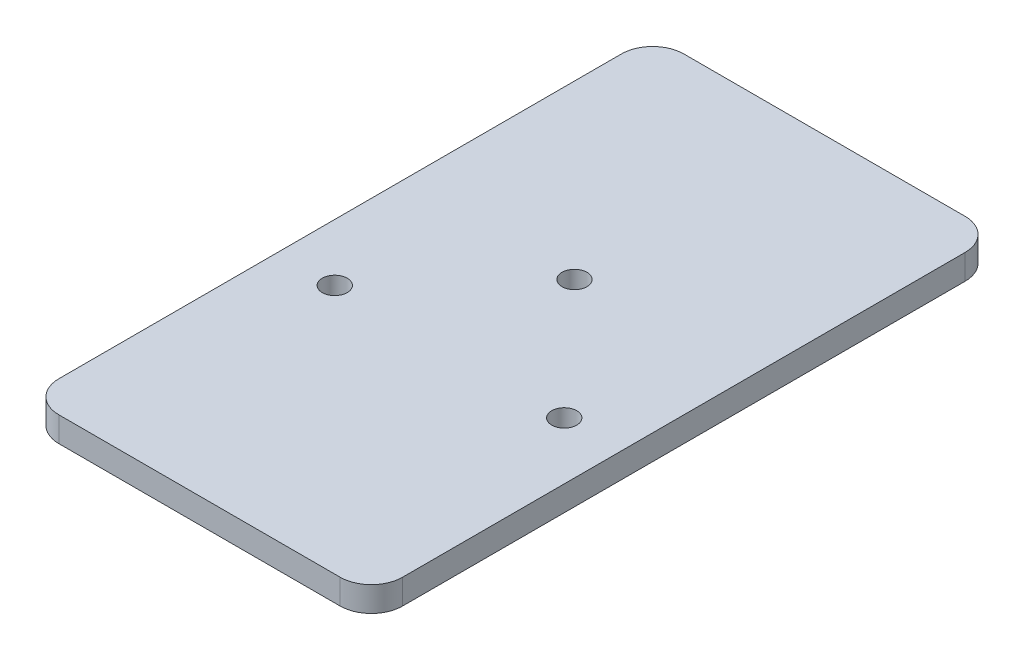
ISO-10303-21;
HEADER;
FILE_DESCRIPTION(('STEP AP214'),'2;1');
FILE_NAME('part.step','',(''),(''),'','','');
FILE_SCHEMA(('AUTOMOTIVE_DESIGN { 1 0 10303 214 1 1 1 1 }'));
ENDSEC;
DATA;
#1=APPLICATION_CONTEXT('core data for automotive mechanical design processes');
#2=APPLICATION_PROTOCOL_DEFINITION('international standard','automotive_design',2000,#1);
#3=PRODUCT_CONTEXT('',#1,'mechanical');
#4=PRODUCT('Part','Part','',(#3));
#5=PRODUCT_RELATED_PRODUCT_CATEGORY('part','',(#4));
#6=PRODUCT_DEFINITION_FORMATION('','',#4);
#7=PRODUCT_DEFINITION_CONTEXT('part definition',#1,'design');
#8=PRODUCT_DEFINITION('design','',#6,#7);
#9=PRODUCT_DEFINITION_SHAPE('','',#8);
#10=(LENGTH_UNIT() NAMED_UNIT(*) SI_UNIT(.MILLI.,.METRE.));
#11=(NAMED_UNIT(*) PLANE_ANGLE_UNIT() SI_UNIT($,.RADIAN.));
#12=(NAMED_UNIT(*) SI_UNIT($,.STERADIAN.) SOLID_ANGLE_UNIT());
#13=UNCERTAINTY_MEASURE_WITH_UNIT(LENGTH_MEASURE(1.E-05),#10,'distance_accuracy_value','');
#14=(GEOMETRIC_REPRESENTATION_CONTEXT(3) GLOBAL_UNCERTAINTY_ASSIGNED_CONTEXT((#13)) GLOBAL_UNIT_ASSIGNED_CONTEXT((#10,
#11,#12)) REPRESENTATION_CONTEXT('',''));
#15=CARTESIAN_POINT('',(0.,0.,0.));
#16=DIRECTION('',(0.,0.,1.));
#17=DIRECTION('',(1.,0.,0.));
#18=AXIS2_PLACEMENT_3D('',#15,#16,#17);
#19=CARTESIAN_POINT('',(-11.25,2.,-22.5));
#20=DIRECTION('',(0.,1.,0.));
#21=DIRECTION('',(0.,0.,1.));
#22=AXIS2_PLACEMENT_3D('',#19,#20,#21);
#23=PLANE('',#22);
#24=CARTESIAN_POINT('',(-9.18,2.,5.));
#25=DIRECTION('',(0.,1.,0.));
#26=DIRECTION('',(0.,0.,1.));
#27=AXIS2_PLACEMENT_3D('',#24,#25,#26);
#28=CIRCLE('',#27,1.);
#29=CARTESIAN_POINT('',(-9.18,2.,6.));
#30=VERTEX_POINT('',#29);
#31=EDGE_CURVE('E184',#30,#30,#28,.T.);
#32=ORIENTED_EDGE('',*,*,#31,.F.);
#33=EDGE_LOOP('',(#32));
#34=FACE_BOUND('',#33,.T.);
#35=CARTESIAN_POINT('',(-11.25,2.,-22.5));
#36=DIRECTION('',(0.,1.,0.));
#37=DIRECTION('',(0.,0.,1.));
#38=AXIS2_PLACEMENT_3D('',#35,#36,#37);
#39=CIRCLE('',#38,2.5);
#40=CARTESIAN_POINT('',(-11.25,2.,-25.));
#41=VERTEX_POINT('',#40);
#42=CARTESIAN_POINT('',(-13.75,2.,-22.5));
#43=VERTEX_POINT('',#42);
#44=EDGE_CURVE('E147',#41,#43,#39,.T.);
#45=ORIENTED_EDGE('',*,*,#44,.T.);
#46=DIRECTION('',(0.,0.,1.));
#47=VECTOR('',#46,1.);
#48=CARTESIAN_POINT('',(-13.75,2.,22.5));
#49=LINE('',#48,#47);
#50=CARTESIAN_POINT('',(-13.75,2.,22.5));
#51=VERTEX_POINT('',#50);
#52=EDGE_CURVE('E95',#43,#51,#49,.T.);
#53=ORIENTED_EDGE('',*,*,#52,.T.);
#54=CARTESIAN_POINT('',(-11.25,2.,22.5));
#55=DIRECTION('',(0.,1.,0.));
#56=DIRECTION('',(0.,0.,-1.));
#57=AXIS2_PLACEMENT_3D('',#54,#55,#56);
#58=CIRCLE('',#57,2.5);
#59=CARTESIAN_POINT('',(-11.25,2.,25.));
#60=VERTEX_POINT('',#59);
#61=EDGE_CURVE('E162',#51,#60,#58,.T.);
#62=ORIENTED_EDGE('',*,*,#61,.T.);
#63=DIRECTION('',(1.,0.,0.));
#64=VECTOR('',#63,1.);
#65=CARTESIAN_POINT('',(-11.25,2.,25.));
#66=LINE('',#65,#64);
#67=CARTESIAN_POINT('',(11.25,2.,25.));
#68=VERTEX_POINT('',#67);
#69=EDGE_CURVE('E175',#60,#68,#66,.T.);
#70=ORIENTED_EDGE('',*,*,#69,.T.);
#71=CARTESIAN_POINT('',(11.25,2.,22.5));
#72=DIRECTION('',(0.,1.,0.));
#73=DIRECTION('',(0.,0.,-1.));
#74=AXIS2_PLACEMENT_3D('',#71,#72,#73);
#75=CIRCLE('',#74,2.5);
#76=CARTESIAN_POINT('',(13.75,2.,22.5));
#77=VERTEX_POINT('',#76);
#78=EDGE_CURVE('E114',#68,#77,#75,.T.);
#79=ORIENTED_EDGE('',*,*,#78,.T.);
#80=DIRECTION('',(0.,0.,-1.));
#81=VECTOR('',#80,1.);
#82=CARTESIAN_POINT('',(13.75,2.,22.5));
#83=LINE('',#82,#81);
#84=CARTESIAN_POINT('',(13.75,2.,-22.5));
#85=VERTEX_POINT('',#84);
#86=EDGE_CURVE('E108',#77,#85,#83,.T.);
#87=ORIENTED_EDGE('',*,*,#86,.T.);
#88=CARTESIAN_POINT('',(11.25,2.,-22.5));
#89=DIRECTION('',(0.,1.,0.));
#90=DIRECTION('',(0.,0.,1.));
#91=AXIS2_PLACEMENT_3D('',#88,#89,#90);
#92=CIRCLE('',#91,2.5);
#93=CARTESIAN_POINT('',(11.25,2.,-25.));
#94=VERTEX_POINT('',#93);
#95=EDGE_CURVE('E112',#85,#94,#92,.T.);
#96=ORIENTED_EDGE('',*,*,#95,.T.);
#97=DIRECTION('',(-1.,0.,0.));
#98=VECTOR('',#97,1.);
#99=CARTESIAN_POINT('',(-11.25,2.,-25.));
#100=LINE('',#99,#98);
#101=EDGE_CURVE('E52',#94,#41,#100,.T.);
#102=ORIENTED_EDGE('',*,*,#101,.T.);
#103=EDGE_LOOP('',(#45,#53,#62,#70,#79,#87,#96,#102));
#104=FACE_BOUND('',#103,.T.);
#105=CARTESIAN_POINT('',(0.,2.,-5.));
#106=DIRECTION('',(0.,1.,0.));
#107=DIRECTION('',(0.,0.,1.));
#108=AXIS2_PLACEMENT_3D('',#105,#106,#107);
#109=CIRCLE('',#108,1.);
#110=CARTESIAN_POINT('',(0.,2.,-4.));
#111=VERTEX_POINT('',#110);
#112=EDGE_CURVE('E136',#111,#111,#109,.T.);
#113=ORIENTED_EDGE('',*,*,#112,.F.);
#114=EDGE_LOOP('',(#113));
#115=FACE_BOUND('',#114,.T.);
#116=CARTESIAN_POINT('',(9.18,2.,5.));
#117=DIRECTION('',(0.,1.,0.));
#118=DIRECTION('',(0.,0.,-1.));
#119=AXIS2_PLACEMENT_3D('',#116,#117,#118);
#120=CIRCLE('',#119,1.);
#121=CARTESIAN_POINT('',(9.18,2.,4.));
#122=VERTEX_POINT('',#121);
#123=EDGE_CURVE('E190',#122,#122,#120,.T.);
#124=ORIENTED_EDGE('',*,*,#123,.F.);
#125=EDGE_LOOP('',(#124));
#126=FACE_BOUND('',#125,.T.);
#127=ADVANCED_FACE('F35',(#34,#104,#115,#126),#23,.T.);
#128=CARTESIAN_POINT('',(-11.25,0.,-22.5));
#129=DIRECTION('',(0.,1.,0.));
#130=DIRECTION('',(0.,0.,1.));
#131=AXIS2_PLACEMENT_3D('',#128,#129,#130);
#132=PLANE('',#131);
#133=CARTESIAN_POINT('',(-9.18,0.,5.));
#134=DIRECTION('',(0.,1.,0.));
#135=DIRECTION('',(0.,0.,1.));
#136=AXIS2_PLACEMENT_3D('',#133,#134,#135);
#137=CIRCLE('',#136,1.);
#138=CARTESIAN_POINT('',(-9.18,0.,6.));
#139=VERTEX_POINT('',#138);
#140=EDGE_CURVE('E187',#139,#139,#137,.T.);
#141=ORIENTED_EDGE('',*,*,#140,.T.);
#142=EDGE_LOOP('',(#141));
#143=FACE_BOUND('',#142,.T.);
#144=CARTESIAN_POINT('',(-11.25,0.,-22.5));
#145=DIRECTION('',(0.,1.,0.));
#146=DIRECTION('',(0.,0.,1.));
#147=AXIS2_PLACEMENT_3D('',#144,#145,#146);
#148=CIRCLE('',#147,2.5);
#149=CARTESIAN_POINT('',(-11.25,0.,-25.));
#150=VERTEX_POINT('',#149);
#151=CARTESIAN_POINT('',(-13.75,0.,-22.5));
#152=VERTEX_POINT('',#151);
#153=EDGE_CURVE('E132',#150,#152,#148,.T.);
#154=ORIENTED_EDGE('',*,*,#153,.F.);
#155=DIRECTION('',(-1.,0.,0.));
#156=VECTOR('',#155,1.);
#157=CARTESIAN_POINT('',(-11.25,0.,-25.));
#158=LINE('',#157,#156);
#159=CARTESIAN_POINT('',(11.25,0.,-25.));
#160=VERTEX_POINT('',#159);
#161=EDGE_CURVE('E87',#160,#150,#158,.T.);
#162=ORIENTED_EDGE('',*,*,#161,.F.);
#163=CARTESIAN_POINT('',(11.25,0.,-22.5));
#164=DIRECTION('',(0.,1.,0.));
#165=DIRECTION('',(0.,0.,1.));
#166=AXIS2_PLACEMENT_3D('',#163,#164,#165);
#167=CIRCLE('',#166,2.5);
#168=CARTESIAN_POINT('',(13.75,0.,-22.5));
#169=VERTEX_POINT('',#168);
#170=EDGE_CURVE('E81',#169,#160,#167,.T.);
#171=ORIENTED_EDGE('',*,*,#170,.F.);
#172=DIRECTION('',(0.,0.,-1.));
#173=VECTOR('',#172,1.);
#174=CARTESIAN_POINT('',(13.75,0.,22.5));
#175=LINE('',#174,#173);
#176=CARTESIAN_POINT('',(13.75,0.,22.5));
#177=VERTEX_POINT('',#176);
#178=EDGE_CURVE('E122',#177,#169,#175,.T.);
#179=ORIENTED_EDGE('',*,*,#178,.F.);
#180=CARTESIAN_POINT('',(11.25,0.,22.5));
#181=DIRECTION('',(0.,1.,0.));
#182=DIRECTION('',(0.,0.,-1.));
#183=AXIS2_PLACEMENT_3D('',#180,#181,#182);
#184=CIRCLE('',#183,2.5);
#185=CARTESIAN_POINT('',(11.25,0.,25.));
#186=VERTEX_POINT('',#185);
#187=EDGE_CURVE('E142',#186,#177,#184,.T.);
#188=ORIENTED_EDGE('',*,*,#187,.F.);
#189=DIRECTION('',(1.,0.,0.));
#190=VECTOR('',#189,1.);
#191=CARTESIAN_POINT('',(-11.25,0.,25.));
#192=LINE('',#191,#190);
#193=CARTESIAN_POINT('',(-11.25,0.,25.));
#194=VERTEX_POINT('',#193);
#195=EDGE_CURVE('E140',#194,#186,#192,.T.);
#196=ORIENTED_EDGE('',*,*,#195,.F.);
#197=CARTESIAN_POINT('',(-11.25,0.,22.5));
#198=DIRECTION('',(0.,1.,0.));
#199=DIRECTION('',(0.,0.,-1.));
#200=AXIS2_PLACEMENT_3D('',#197,#198,#199);
#201=CIRCLE('',#200,2.5);
#202=CARTESIAN_POINT('',(-13.75,0.,22.5));
#203=VERTEX_POINT('',#202);
#204=EDGE_CURVE('E138',#203,#194,#201,.T.);
#205=ORIENTED_EDGE('',*,*,#204,.F.);
#206=DIRECTION('',(0.,0.,1.));
#207=VECTOR('',#206,1.);
#208=CARTESIAN_POINT('',(-13.75,0.,22.5));
#209=LINE('',#208,#207);
#210=EDGE_CURVE('E135',#152,#203,#209,.T.);
#211=ORIENTED_EDGE('',*,*,#210,.F.);
#212=EDGE_LOOP('',(#154,#162,#171,#179,#188,#196,#205,#211));
#213=FACE_BOUND('',#212,.T.);
#214=CARTESIAN_POINT('',(0.,0.,-5.));
#215=DIRECTION('',(0.,1.,0.));
#216=DIRECTION('',(0.,0.,1.));
#217=AXIS2_PLACEMENT_3D('',#214,#215,#216);
#218=CIRCLE('',#217,1.);
#219=CARTESIAN_POINT('',(0.,0.,-4.));
#220=VERTEX_POINT('',#219);
#221=EDGE_CURVE('E181',#220,#220,#218,.T.);
#222=ORIENTED_EDGE('',*,*,#221,.T.);
#223=EDGE_LOOP('',(#222));
#224=FACE_BOUND('',#223,.T.);
#225=CARTESIAN_POINT('',(9.18,0.,5.));
#226=DIRECTION('',(0.,1.,0.));
#227=DIRECTION('',(0.,0.,-1.));
#228=AXIS2_PLACEMENT_3D('',#225,#226,#227);
#229=CIRCLE('',#228,1.);
#230=CARTESIAN_POINT('',(9.18,0.,4.));
#231=VERTEX_POINT('',#230);
#232=EDGE_CURVE('E193',#231,#231,#229,.T.);
#233=ORIENTED_EDGE('',*,*,#232,.T.);
#234=EDGE_LOOP('',(#233));
#235=FACE_BOUND('',#234,.T.);
#236=ADVANCED_FACE('F166',(#143,#213,#224,#235),#132,.F.);
#237=CARTESIAN_POINT('',(-11.25,2.,-22.5));
#238=DIRECTION('',(0.,-1.,0.));
#239=DIRECTION('',(0.,0.,-1.));
#240=AXIS2_PLACEMENT_3D('',#237,#238,#239);
#241=CYLINDRICAL_SURFACE('',#240,2.5);
#242=ORIENTED_EDGE('',*,*,#153,.T.);
#243=DIRECTION('',(0.,-1.,0.));
#244=VECTOR('',#243,1.);
#245=CARTESIAN_POINT('',(-13.75,2.,-22.5));
#246=LINE('',#245,#244);
#247=EDGE_CURVE('E11',#43,#152,#246,.T.);
#248=ORIENTED_EDGE('',*,*,#247,.F.);
#249=ORIENTED_EDGE('',*,*,#44,.F.);
#250=DIRECTION('',(0.,-1.,0.));
#251=VECTOR('',#250,1.);
#252=CARTESIAN_POINT('',(-11.25,2.,-25.));
#253=LINE('',#252,#251);
#254=EDGE_CURVE('E128',#41,#150,#253,.T.);
#255=ORIENTED_EDGE('',*,*,#254,.T.);
#256=EDGE_LOOP('',(#242,#248,#249,#255));
#257=FACE_BOUND('',#256,.T.);
#258=ADVANCED_FACE('F37',(#257),#241,.T.);
#259=CARTESIAN_POINT('',(-13.75,2.,22.5));
#260=DIRECTION('',(1.,0.,0.));
#261=DIRECTION('',(0.,0.,-1.));
#262=AXIS2_PLACEMENT_3D('',#259,#260,#261);
#263=PLANE('',#262);
#264=ORIENTED_EDGE('',*,*,#210,.T.);
#265=DIRECTION('',(0.,-1.,0.));
#266=VECTOR('',#265,1.);
#267=CARTESIAN_POINT('',(-13.75,2.,22.5));
#268=LINE('',#267,#266);
#269=EDGE_CURVE('E44',#51,#203,#268,.T.);
#270=ORIENTED_EDGE('',*,*,#269,.F.);
#271=ORIENTED_EDGE('',*,*,#52,.F.);
#272=ORIENTED_EDGE('',*,*,#247,.T.);
#273=EDGE_LOOP('',(#264,#270,#271,#272));
#274=FACE_BOUND('',#273,.T.);
#275=ADVANCED_FACE('F227',(#274),#263,.F.);
#276=CARTESIAN_POINT('',(-11.25,2.,22.5));
#277=DIRECTION('',(0.,-1.,0.));
#278=DIRECTION('',(0.,0.,-1.));
#279=AXIS2_PLACEMENT_3D('',#276,#277,#278);
#280=CYLINDRICAL_SURFACE('',#279,2.5);
#281=ORIENTED_EDGE('',*,*,#204,.T.);
#282=DIRECTION('',(0.,-1.,0.));
#283=VECTOR('',#282,1.);
#284=CARTESIAN_POINT('',(-11.25,2.,25.));
#285=LINE('',#284,#283);
#286=EDGE_CURVE('E154',#60,#194,#285,.T.);
#287=ORIENTED_EDGE('',*,*,#286,.F.);
#288=ORIENTED_EDGE('',*,*,#61,.F.);
#289=ORIENTED_EDGE('',*,*,#269,.T.);
#290=EDGE_LOOP('',(#281,#287,#288,#289));
#291=FACE_BOUND('',#290,.T.);
#292=ADVANCED_FACE('F160',(#291),#280,.T.);
#293=CARTESIAN_POINT('',(-11.25,2.,25.));
#294=DIRECTION('',(0.,0.,-1.));
#295=DIRECTION('',(-1.,0.,0.));
#296=AXIS2_PLACEMENT_3D('',#293,#294,#295);
#297=PLANE('',#296);
#298=ORIENTED_EDGE('',*,*,#195,.T.);
#299=DIRECTION('',(0.,-1.,0.));
#300=VECTOR('',#299,1.);
#301=CARTESIAN_POINT('',(11.25,2.,25.));
#302=LINE('',#301,#300);
#303=EDGE_CURVE('E151',#68,#186,#302,.T.);
#304=ORIENTED_EDGE('',*,*,#303,.F.);
#305=ORIENTED_EDGE('',*,*,#69,.F.);
#306=ORIENTED_EDGE('',*,*,#286,.T.);
#307=EDGE_LOOP('',(#298,#304,#305,#306));
#308=FACE_BOUND('',#307,.T.);
#309=ADVANCED_FACE('F171',(#308),#297,.F.);
#310=CARTESIAN_POINT('',(11.25,2.,22.5));
#311=DIRECTION('',(0.,-1.,0.));
#312=DIRECTION('',(0.,0.,-1.));
#313=AXIS2_PLACEMENT_3D('',#310,#311,#312);
#314=CYLINDRICAL_SURFACE('',#313,2.5);
#315=ORIENTED_EDGE('',*,*,#187,.T.);
#316=DIRECTION('',(0.,-1.,0.));
#317=VECTOR('',#316,1.);
#318=CARTESIAN_POINT('',(13.75,2.,22.5));
#319=LINE('',#318,#317);
#320=EDGE_CURVE('E123',#77,#177,#319,.T.);
#321=ORIENTED_EDGE('',*,*,#320,.F.);
#322=ORIENTED_EDGE('',*,*,#78,.F.);
#323=ORIENTED_EDGE('',*,*,#303,.T.);
#324=EDGE_LOOP('',(#315,#321,#322,#323));
#325=FACE_BOUND('',#324,.T.);
#326=ADVANCED_FACE('F174',(#325),#314,.T.);
#327=CARTESIAN_POINT('',(13.75,2.,22.5));
#328=DIRECTION('',(-1.,0.,0.));
#329=DIRECTION('',(0.,0.,1.));
#330=AXIS2_PLACEMENT_3D('',#327,#328,#329);
#331=PLANE('',#330);
#332=ORIENTED_EDGE('',*,*,#178,.T.);
#333=DIRECTION('',(0.,-1.,0.));
#334=VECTOR('',#333,1.);
#335=CARTESIAN_POINT('',(13.75,2.,-22.5));
#336=LINE('',#335,#334);
#337=EDGE_CURVE('E119',#85,#169,#336,.T.);
#338=ORIENTED_EDGE('',*,*,#337,.F.);
#339=ORIENTED_EDGE('',*,*,#86,.F.);
#340=ORIENTED_EDGE('',*,*,#320,.T.);
#341=EDGE_LOOP('',(#332,#338,#339,#340));
#342=FACE_BOUND('',#341,.T.);
#343=ADVANCED_FACE('F120',(#342),#331,.F.);
#344=CARTESIAN_POINT('',(11.25,2.,-22.5));
#345=DIRECTION('',(0.,-1.,0.));
#346=DIRECTION('',(0.,0.,-1.));
#347=AXIS2_PLACEMENT_3D('',#344,#345,#346);
#348=CYLINDRICAL_SURFACE('',#347,2.5);
#349=ORIENTED_EDGE('',*,*,#170,.T.);
#350=DIRECTION('',(0.,-1.,0.));
#351=VECTOR('',#350,1.);
#352=CARTESIAN_POINT('',(11.25,2.,-25.));
#353=LINE('',#352,#351);
#354=EDGE_CURVE('E124',#94,#160,#353,.T.);
#355=ORIENTED_EDGE('',*,*,#354,.F.);
#356=ORIENTED_EDGE('',*,*,#95,.F.);
#357=ORIENTED_EDGE('',*,*,#337,.T.);
#358=EDGE_LOOP('',(#349,#355,#356,#357));
#359=FACE_BOUND('',#358,.T.);
#360=ADVANCED_FACE('F126',(#359),#348,.T.);
#361=CARTESIAN_POINT('',(-11.25,2.,-25.));
#362=DIRECTION('',(0.,0.,1.));
#363=DIRECTION('',(1.,0.,0.));
#364=AXIS2_PLACEMENT_3D('',#361,#362,#363);
#365=PLANE('',#364);
#366=ORIENTED_EDGE('',*,*,#161,.T.);
#367=ORIENTED_EDGE('',*,*,#254,.F.);
#368=ORIENTED_EDGE('',*,*,#101,.F.);
#369=ORIENTED_EDGE('',*,*,#354,.T.);
#370=EDGE_LOOP('',(#366,#367,#368,#369));
#371=FACE_BOUND('',#370,.T.);
#372=ADVANCED_FACE('F215',(#371),#365,.F.);
#373=CARTESIAN_POINT('',(0.,2.,-5.));
#374=DIRECTION('',(0.,-1.,0.));
#375=DIRECTION('',(0.,0.,-1.));
#376=AXIS2_PLACEMENT_3D('',#373,#374,#375);
#377=CYLINDRICAL_SURFACE('',#376,1.);
#378=ORIENTED_EDGE('',*,*,#112,.T.);
#379=EDGE_LOOP('',(#378));
#380=FACE_BOUND('',#379,.T.);
#381=ORIENTED_EDGE('',*,*,#221,.F.);
#382=EDGE_LOOP('',(#381));
#383=FACE_BOUND('',#382,.T.);
#384=ADVANCED_FACE('F212',(#380,#383),#377,.F.);
#385=CARTESIAN_POINT('',(-9.18,2.,5.));
#386=DIRECTION('',(0.,-1.,0.));
#387=DIRECTION('',(0.,0.,-1.));
#388=AXIS2_PLACEMENT_3D('',#385,#386,#387);
#389=CYLINDRICAL_SURFACE('',#388,1.);
#390=ORIENTED_EDGE('',*,*,#31,.T.);
#391=EDGE_LOOP('',(#390));
#392=FACE_BOUND('',#391,.T.);
#393=ORIENTED_EDGE('',*,*,#140,.F.);
#394=EDGE_LOOP('',(#393));
#395=FACE_BOUND('',#394,.T.);
#396=ADVANCED_FACE('F291',(#392,#395),#389,.F.);
#397=CARTESIAN_POINT('',(9.18,2.,5.));
#398=DIRECTION('',(0.,-1.,0.));
#399=DIRECTION('',(0.,0.,-1.));
#400=AXIS2_PLACEMENT_3D('',#397,#398,#399);
#401=CYLINDRICAL_SURFACE('',#400,1.);
#402=ORIENTED_EDGE('',*,*,#123,.T.);
#403=EDGE_LOOP('',(#402));
#404=FACE_BOUND('',#403,.T.);
#405=ORIENTED_EDGE('',*,*,#232,.F.);
#406=EDGE_LOOP('',(#405));
#407=FACE_BOUND('',#406,.T.);
#408=ADVANCED_FACE('F199',(#404,#407),#401,.F.);
#409=CLOSED_SHELL('',(#127,#236,#258,#275,#292,#309,#326,#343,#360,#372,#384,#396,#408));
#410=MANIFOLD_SOLID_BREP('B2',#409);
#411=ADVANCED_BREP_SHAPE_REPRESENTATION('',(#18,#410),#14);
#412=SHAPE_DEFINITION_REPRESENTATION(#9,#411);
ENDSEC;
END-ISO-10303-21;
